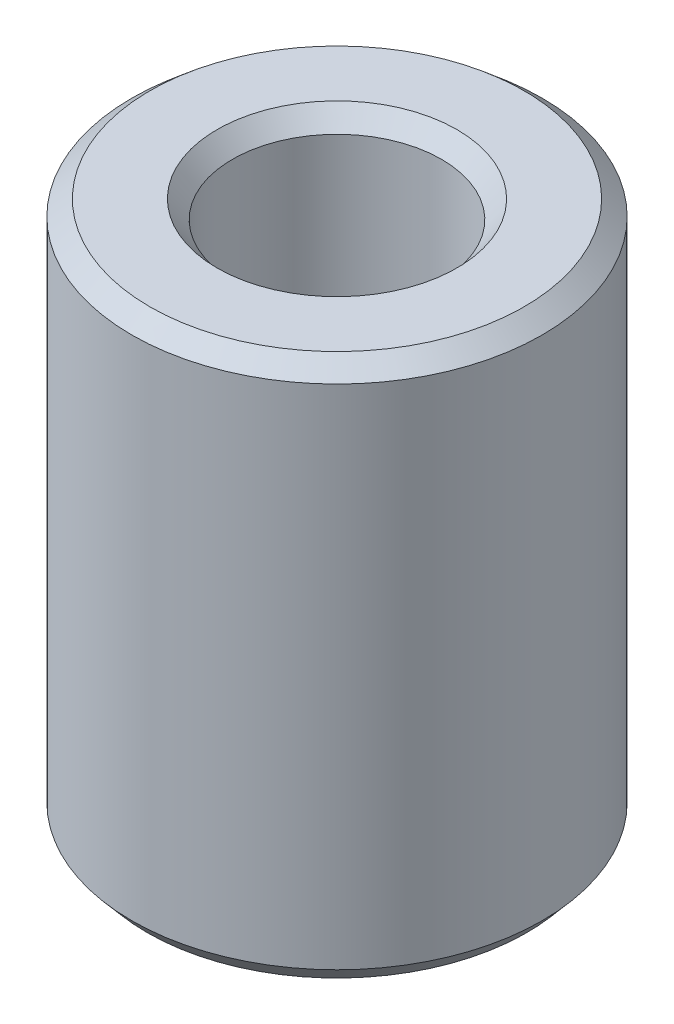
ISO-10303-21;
HEADER;
FILE_DESCRIPTION(('STEP AP214'),'2;1');
FILE_NAME('part.step','',(''),(''),'','','');
FILE_SCHEMA(('AUTOMOTIVE_DESIGN { 1 0 10303 214 1 1 1 1 }'));
ENDSEC;
DATA;
#1=APPLICATION_CONTEXT('core data for automotive mechanical design processes');
#2=APPLICATION_PROTOCOL_DEFINITION('international standard','automotive_design',2000,#1);
#3=PRODUCT_CONTEXT('',#1,'mechanical');
#4=PRODUCT('Part','Part','',(#3));
#5=PRODUCT_RELATED_PRODUCT_CATEGORY('part','',(#4));
#6=PRODUCT_DEFINITION_FORMATION('','',#4);
#7=PRODUCT_DEFINITION_CONTEXT('part definition',#1,'design');
#8=PRODUCT_DEFINITION('design','',#6,#7);
#9=PRODUCT_DEFINITION_SHAPE('','',#8);
#10=(LENGTH_UNIT() NAMED_UNIT(*) SI_UNIT(.MILLI.,.METRE.));
#11=(NAMED_UNIT(*) PLANE_ANGLE_UNIT() SI_UNIT($,.RADIAN.));
#12=(NAMED_UNIT(*) SI_UNIT($,.STERADIAN.) SOLID_ANGLE_UNIT());
#13=UNCERTAINTY_MEASURE_WITH_UNIT(LENGTH_MEASURE(1.E-05),#10,'distance_accuracy_value','');
#14=(GEOMETRIC_REPRESENTATION_CONTEXT(3) GLOBAL_UNCERTAINTY_ASSIGNED_CONTEXT((#13)) GLOBAL_UNIT_ASSIGNED_CONTEXT((#10,
#11,#12)) REPRESENTATION_CONTEXT('',''));
#15=CARTESIAN_POINT('',(0.,0.,0.));
#16=DIRECTION('',(0.,0.,1.));
#17=DIRECTION('',(1.,0.,0.));
#18=AXIS2_PLACEMENT_3D('',#15,#16,#17);
#19=CARTESIAN_POINT('',(0.,32.9396818082115,0.));
#20=DIRECTION('',(0.,-1.,0.));
#21=DIRECTION('',(0.,0.,-1.));
#22=AXIS2_PLACEMENT_3D('',#19,#20,#21);
#23=CYLINDRICAL_SURFACE('',#22,12.5);
#24=CARTESIAN_POINT('',(0.,1.09940932197312,0.));
#25=DIRECTION('',(0.,1.,0.));
#26=DIRECTION('',(0.,0.,1.));
#27=AXIS2_PLACEMENT_3D('',#24,#25,#26);
#28=CIRCLE('',#27,12.5);
#29=CARTESIAN_POINT('',(0.,1.09940932197312,12.5));
#30=VERTEX_POINT('',#29);
#31=EDGE_CURVE('E10',#30,#30,#28,.T.);
#32=ORIENTED_EDGE('',*,*,#31,.T.);
#33=EDGE_LOOP('',(#32));
#34=FACE_BOUND('',#33,.T.);
#35=CARTESIAN_POINT('',(0.,32.0025255558294,0.));
#36=DIRECTION('',(0.,1.,0.));
#37=DIRECTION('',(0.,0.,1.));
#38=AXIS2_PLACEMENT_3D('',#35,#36,#37);
#39=CIRCLE('',#38,12.5);
#40=CARTESIAN_POINT('',(0.,32.0025255558294,12.5));
#41=VERTEX_POINT('',#40);
#42=EDGE_CURVE('E50',#41,#41,#39,.F.);
#43=ORIENTED_EDGE('',*,*,#42,.T.);
#44=EDGE_LOOP('',(#43));
#45=FACE_BOUND('',#44,.T.);
#46=ADVANCED_FACE('F39',(#34,#45),#23,.T.);
#47=CARTESIAN_POINT('',(0.,32.9396818082115,0.));
#48=DIRECTION('',(0.,1.,0.));
#49=DIRECTION('',(0.,0.,1.));
#50=AXIS2_PLACEMENT_3D('',#47,#48,#49);
#51=PLANE('',#50);
#52=CARTESIAN_POINT('',(0.,32.9396818082115,0.));
#53=DIRECTION('',(0.,1.,0.));
#54=DIRECTION('',(0.,0.,1.));
#55=AXIS2_PLACEMENT_3D('',#52,#53,#54);
#56=CIRCLE('',#55,7.30671101132766);
#57=CARTESIAN_POINT('',(0.,32.9396818082115,7.30671101132766));
#58=VERTEX_POINT('',#57);
#59=EDGE_CURVE('E58',#58,#58,#56,.F.);
#60=ORIENTED_EDGE('',*,*,#59,.T.);
#61=EDGE_LOOP('',(#60));
#62=FACE_BOUND('',#61,.T.);
#63=CARTESIAN_POINT('',(0.,32.9396818082115,0.));
#64=DIRECTION('',(0.,1.,0.));
#65=DIRECTION('',(0.,0.,1.));
#66=AXIS2_PLACEMENT_3D('',#63,#64,#65);
#67=CIRCLE('',#66,11.4005906780269);
#68=CARTESIAN_POINT('',(0.,32.9396818082115,11.4005906780269));
#69=VERTEX_POINT('',#68);
#70=EDGE_CURVE('E61',#69,#69,#67,.T.);
#71=ORIENTED_EDGE('',*,*,#70,.T.);
#72=EDGE_LOOP('',(#71));
#73=FACE_BOUND('',#72,.T.);
#74=ADVANCED_FACE('F88',(#62,#73),#51,.T.);
#75=CARTESIAN_POINT('',(0.,0.,0.));
#76=DIRECTION('',(0.,1.,0.));
#77=DIRECTION('',(0.,0.,1.));
#78=AXIS2_PLACEMENT_3D('',#75,#76,#77);
#79=PLANE('',#78);
#80=CARTESIAN_POINT('',(0.,0.,0.));
#81=DIRECTION('',(0.,1.,0.));
#82=DIRECTION('',(0.,0.,1.));
#83=AXIS2_PLACEMENT_3D('',#80,#81,#82);
#84=CIRCLE('',#83,7.46896408091862);
#85=CARTESIAN_POINT('',(0.,0.,7.46896408091862));
#86=VERTEX_POINT('',#85);
#87=EDGE_CURVE('E51',#86,#86,#84,.T.);
#88=ORIENTED_EDGE('',*,*,#87,.T.);
#89=EDGE_LOOP('',(#88));
#90=FACE_BOUND('',#89,.T.);
#91=CARTESIAN_POINT('',(0.,0.,0.));
#92=DIRECTION('',(0.,1.,0.));
#93=DIRECTION('',(0.,0.,1.));
#94=AXIS2_PLACEMENT_3D('',#91,#92,#93);
#95=CIRCLE('',#94,11.5628437476178);
#96=CARTESIAN_POINT('',(0.,0.,11.5628437476178));
#97=VERTEX_POINT('',#96);
#98=EDGE_CURVE('E54',#97,#97,#95,.F.);
#99=ORIENTED_EDGE('',*,*,#98,.T.);
#100=EDGE_LOOP('',(#99));
#101=FACE_BOUND('',#100,.T.);
#102=ADVANCED_FACE('F83',(#90,#101),#79,.F.);
#103=CARTESIAN_POINT('',(0.,32.9396818082115,0.));
#104=DIRECTION('',(0.,-1.,0.));
#105=DIRECTION('',(0.,0.,-1.));
#106=AXIS2_PLACEMENT_3D('',#103,#104,#105);
#107=CYLINDRICAL_SURFACE('',#106,6.3695547589455);
#108=CARTESIAN_POINT('',(0.,31.8402724862384,0.));
#109=DIRECTION('',(0.,1.,0.));
#110=DIRECTION('',(0.,0.,1.));
#111=AXIS2_PLACEMENT_3D('',#108,#109,#110);
#112=CIRCLE('',#111,6.3695547589455);
#113=CARTESIAN_POINT('',(0.,31.8402724862384,6.3695547589455));
#114=VERTEX_POINT('',#113);
#115=EDGE_CURVE('E67',#114,#114,#112,.T.);
#116=ORIENTED_EDGE('',*,*,#115,.T.);
#117=EDGE_LOOP('',(#116));
#118=FACE_BOUND('',#117,.T.);
#119=CARTESIAN_POINT('',(0.,0.937156252382158,0.));
#120=DIRECTION('',(0.,1.,0.));
#121=DIRECTION('',(0.,0.,1.));
#122=AXIS2_PLACEMENT_3D('',#119,#120,#121);
#123=CIRCLE('',#122,6.3695547589455);
#124=CARTESIAN_POINT('',(0.,0.937156252382158,6.3695547589455));
#125=VERTEX_POINT('',#124);
#126=EDGE_CURVE('E69',#125,#125,#123,.F.);
#127=ORIENTED_EDGE('',*,*,#126,.T.);
#128=EDGE_LOOP('',(#127));
#129=FACE_BOUND('',#128,.T.);
#130=ADVANCED_FACE('F71',(#118,#129),#107,.F.);
#131=CARTESIAN_POINT('',(0.,31.8402724862384,0.));
#132=DIRECTION('',(0.,1.,0.));
#133=DIRECTION('',(0.,0.,1.));
#134=AXIS2_PLACEMENT_3D('',#131,#132,#133);
#135=CONICAL_SURFACE('',#134,6.3695547589455,0.70589614124027);
#136=ORIENTED_EDGE('',*,*,#59,.F.);
#137=EDGE_LOOP('',(#136));
#138=FACE_BOUND('',#137,.T.);
#139=ORIENTED_EDGE('',*,*,#115,.F.);
#140=EDGE_LOOP('',(#139));
#141=FACE_BOUND('',#140,.T.);
#142=ADVANCED_FACE('F77',(#138,#141),#135,.F.);
#143=CARTESIAN_POINT('',(0.,0.,0.));
#144=DIRECTION('',(0.,-1.,0.));
#145=DIRECTION('',(0.,0.,-1.));
#146=AXIS2_PLACEMENT_3D('',#143,#144,#145);
#147=CONICAL_SURFACE('',#146,7.46896408091862,0.864900185554626);
#148=ORIENTED_EDGE('',*,*,#126,.F.);
#149=EDGE_LOOP('',(#148));
#150=FACE_BOUND('',#149,.T.);
#151=ORIENTED_EDGE('',*,*,#87,.F.);
#152=EDGE_LOOP('',(#151));
#153=FACE_BOUND('',#152,.T.);
#154=ADVANCED_FACE('F73',(#150,#153),#147,.F.);
#155=CARTESIAN_POINT('',(0.,1.09940932197312,0.));
#156=DIRECTION('',(0.,1.,0.));
#157=DIRECTION('',(0.,0.,1.));
#158=AXIS2_PLACEMENT_3D('',#155,#156,#157);
#159=CONICAL_SURFACE('',#158,12.5,0.705896141240272);
#160=ORIENTED_EDGE('',*,*,#98,.F.);
#161=EDGE_LOOP('',(#160));
#162=FACE_BOUND('',#161,.T.);
#163=ORIENTED_EDGE('',*,*,#31,.F.);
#164=EDGE_LOOP('',(#163));
#165=FACE_BOUND('',#164,.T.);
#166=ADVANCED_FACE('F76',(#162,#165),#159,.T.);
#167=CARTESIAN_POINT('',(0.,32.9396818082115,0.));
#168=DIRECTION('',(0.,-1.,0.));
#169=DIRECTION('',(0.,0.,-1.));
#170=AXIS2_PLACEMENT_3D('',#167,#168,#169);
#171=CONICAL_SURFACE('',#170,11.4005906780269,0.864900185554626);
#172=ORIENTED_EDGE('',*,*,#42,.F.);
#173=EDGE_LOOP('',(#172));
#174=FACE_BOUND('',#173,.T.);
#175=ORIENTED_EDGE('',*,*,#70,.F.);
#176=EDGE_LOOP('',(#175));
#177=FACE_BOUND('',#176,.T.);
#178=ADVANCED_FACE('F45',(#174,#177),#171,.T.);
#179=CLOSED_SHELL('',(#46,#74,#102,#130,#142,#154,#166,#178));
#180=MANIFOLD_SOLID_BREP('B2',#179);
#181=ADVANCED_BREP_SHAPE_REPRESENTATION('',(#18,#180),#14);
#182=SHAPE_DEFINITION_REPRESENTATION(#9,#181);
ENDSEC;
END-ISO-10303-21;
